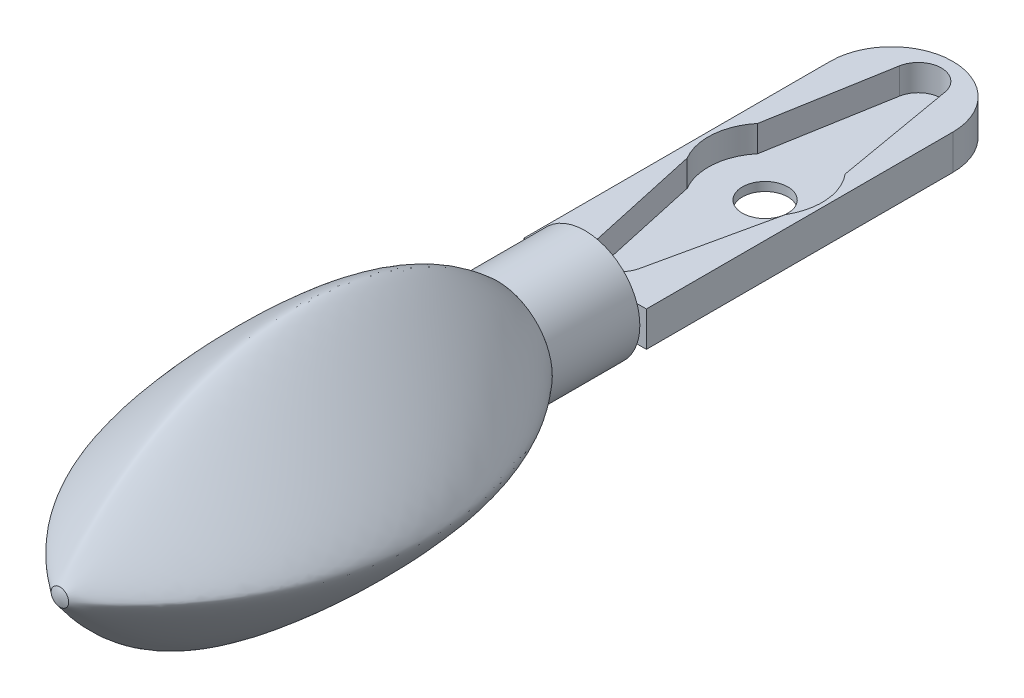
ISO-10303-21;
HEADER;
FILE_DESCRIPTION(('STEP AP214'),'2;1');
FILE_NAME('part.step','',(''),(''),'','','');
FILE_SCHEMA(('AUTOMOTIVE_DESIGN { 1 0 10303 214 1 1 1 1 }'));
ENDSEC;
DATA;
#1=APPLICATION_CONTEXT('core data for automotive mechanical design processes');
#2=APPLICATION_PROTOCOL_DEFINITION('international standard','automotive_design',2000,#1);
#3=PRODUCT_CONTEXT('',#1,'mechanical');
#4=PRODUCT('Part','Part','',(#3));
#5=PRODUCT_RELATED_PRODUCT_CATEGORY('part','',(#4));
#6=PRODUCT_DEFINITION_FORMATION('','',#4);
#7=PRODUCT_DEFINITION_CONTEXT('part definition',#1,'design');
#8=PRODUCT_DEFINITION('design','',#6,#7);
#9=PRODUCT_DEFINITION_SHAPE('','',#8);
#10=(LENGTH_UNIT() NAMED_UNIT(*) SI_UNIT(.MILLI.,.METRE.));
#11=(NAMED_UNIT(*) PLANE_ANGLE_UNIT() SI_UNIT($,.RADIAN.));
#12=(NAMED_UNIT(*) SI_UNIT($,.STERADIAN.) SOLID_ANGLE_UNIT());
#13=UNCERTAINTY_MEASURE_WITH_UNIT(LENGTH_MEASURE(1.E-05),#10,'distance_accuracy_value','');
#14=(GEOMETRIC_REPRESENTATION_CONTEXT(3) GLOBAL_UNCERTAINTY_ASSIGNED_CONTEXT((#13)) GLOBAL_UNIT_ASSIGNED_CONTEXT((#10,
#11,#12)) REPRESENTATION_CONTEXT('',''));
#15=CARTESIAN_POINT('',(0.,0.,0.));
#16=DIRECTION('',(0.,0.,1.));
#17=DIRECTION('',(1.,0.,0.));
#18=AXIS2_PLACEMENT_3D('',#15,#16,#17);
#19=CARTESIAN_POINT('',(7.,-8.25,10.));
#20=DIRECTION('',(0.,0.,1.));
#21=DIRECTION('',(0.,-1.,0.));
#22=AXIS2_PLACEMENT_3D('',#19,#20,#21);
#23=PLANE('',#22);
#24=CARTESIAN_POINT('',(7.,4.25,10.));
#25=CARTESIAN_POINT('',(7.81812308154913,4.25,10.));
#26=CARTESIAN_POINT('',(9.4540963744495,3.92493754223876,10.));
#27=CARTESIAN_POINT('',(11.5345744645811,2.53457446458112,9.99999999999999));
#28=CARTESIAN_POINT('',(12.9249375422388,0.454096374449511,10.));
#29=CARTESIAN_POINT('',(13.25,-1.18187691845087,10.));
#30=CARTESIAN_POINT('',(13.25,-2.81812308154913,10.));
#31=CARTESIAN_POINT('',(12.9249375422387,-4.45409637444951,10.));
#32=CARTESIAN_POINT('',(11.5345744645811,-6.53457446458112,9.99999999999999));
#33=CARTESIAN_POINT('',(9.4540963744495,-7.92493754223876,10.));
#34=CARTESIAN_POINT('',(7.81812308154913,-8.25,10.));
#35=CARTESIAN_POINT('',(6.18187691845087,-8.25,10.));
#36=CARTESIAN_POINT('',(4.54590362555049,-7.92493754223878,10.));
#37=CARTESIAN_POINT('',(2.46542553541888,-6.53457446458111,9.99999999999998));
#38=CARTESIAN_POINT('',(1.07506245776123,-4.45409637444951,10.));
#39=CARTESIAN_POINT('',(0.75,-2.81812308154913,10.));
#40=CARTESIAN_POINT('',(0.75,-1.18187691845087,10.));
#41=CARTESIAN_POINT('',(1.07506245776123,0.454096374449508,10.));
#42=CARTESIAN_POINT('',(2.46542553541888,2.53457446458112,9.99999999999999));
#43=CARTESIAN_POINT('',(4.54590362555049,3.92493754223876,10.));
#44=CARTESIAN_POINT('',(6.18187691845087,4.25,10.));
#45=CARTESIAN_POINT('',(7.,4.25,10.));
#46=B_SPLINE_CURVE_WITH_KNOTS('',3,(#24,#25,#26,#27,#28,#29,#30,#31,#32,#33,#34,#35,#36,#37,#38,
#39,#40,#41,#42,#43,#44,#45),.UNSPECIFIED.,.T.,.F.,(4,1,1,1,2,1,1,1,2,1,1,1,2,1,1,1,4),(0.,
0.0625,0.125,0.1875,0.25,0.3125,0.375,0.4375,0.5,0.5625,0.625,0.6875,0.75,0.8125,0.875,0.9375,
1.),.UNSPECIFIED.);
#47=CARTESIAN_POINT('',(7.,4.25,10.));
#48=VERTEX_POINT('',#47);
#49=EDGE_CURVE('E136',#48,#48,#46,.F.);
#50=ORIENTED_EDGE('',*,*,#49,.F.);
#51=EDGE_LOOP('',(#50));
#52=FACE_BOUND('',#51,.T.);
#53=ADVANCED_FACE('F126',(#52),#23,.F.);
#54=CARTESIAN_POINT('',(8.02000049254447,-3.01999969585642,59.8401923019378));
#55=CARTESIAN_POINT('',(8.0200003708871,-2.61199969585646,59.9616459711477));
#56=CARTESIAN_POINT('',(8.02000024922972,-2.20399969585649,60.0247645805953));
#57=CARTESIAN_POINT('',(8.02000012757235,-1.79599969585653,60.0248127844808));
#58=CARTESIAN_POINT('',(8.02000000591497,-1.38799969585656,59.9616639741347));
#59=CARTESIAN_POINT('',(8.0199998842576,-0.979999695856598,59.839748853044));
#60=CARTESIAN_POINT('',(7.81600045486427,-3.01999975668512,59.8849188797109));
#61=CARTESIAN_POINT('',(7.81600033320689,-2.61199975668515,60.0199655089057));
#62=CARTESIAN_POINT('',(7.81600021154952,-2.20399975668519,60.09365260845));
#63=CARTESIAN_POINT('',(7.81600008989214,-1.79599975668522,60.093563305668));
#64=CARTESIAN_POINT('',(7.81599996823477,-1.38799975668526,60.0200922677023));
#65=CARTESIAN_POINT('',(7.81599984657739,-0.979999756685296,59.8845755523706));
#66=CARTESIAN_POINT('',(7.61200041718406,-3.01999981751382,59.9265692175429));
#67=CARTESIAN_POINT('',(7.61200029552669,-2.61199981751385,60.0757067128921));
#68=CARTESIAN_POINT('',(7.61200017386931,-2.20399981751389,60.1594772058036));
#69=CARTESIAN_POINT('',(7.61200005221194,-1.79599981751392,60.159214782936));
#70=CARTESIAN_POINT('',(7.61199993055456,-1.38799981751396,60.0760089379399));
#71=CARTESIAN_POINT('',(7.61199980889719,-0.979999817513994,59.9262927873224));
#72=CARTESIAN_POINT('',(7.40800037950386,-3.01999987834251,59.9686196393909));
#73=CARTESIAN_POINT('',(7.40800025784648,-2.61199987834255,60.1376041003941));
#74=CARTESIAN_POINT('',(7.40800013618911,-2.20399987834258,60.2263131086476));
#75=CARTESIAN_POINT('',(7.40800001453173,-1.79599987834262,60.2264096595951));
#76=CARTESIAN_POINT('',(7.40799989287436,-1.38799987834266,60.1378791670536));
#77=CARTESIAN_POINT('',(7.40799977121698,-0.979999878342693,59.9683481275886));
#78=CARTESIAN_POINT('',(7.16320032412943,-3.01999995133695,59.9959072130528));
#79=CARTESIAN_POINT('',(7.16320020247206,-2.61199995133699,60.1844968601696));
#80=CARTESIAN_POINT('',(7.16320008081468,-2.20399995133702,60.2659199573564));
#81=CARTESIAN_POINT('',(7.16319995915731,-1.79599995133706,60.2646441625595));
#82=CARTESIAN_POINT('',(7.16319983749993,-1.3879999513371,60.1853156593904));
#83=CARTESIAN_POINT('',(7.16319971584256,-0.979999951337134,59.9955332328288));
#84=CARTESIAN_POINT('',(6.918400268755,-3.0200000243314,59.9906507336328));
#85=CARTESIAN_POINT('',(6.91840014709763,-2.61200002433143,60.1755034043456));
#86=CARTESIAN_POINT('',(6.91840002544025,-2.20400002433147,60.2579290514293));
#87=CARTESIAN_POINT('',(6.91839990378288,-1.7960000243315,60.2568729161097));
#88=CARTESIAN_POINT('',(6.9183997821255,-1.38800002433154,60.1762889863471));
#89=CARTESIAN_POINT('',(6.91839966046813,-0.980000024331575,59.9902196983231));
#90=CARTESIAN_POINT('',(6.87760025106078,-3.02000003649714,59.9888641701939));
#91=CARTESIAN_POINT('',(6.87760012940341,-2.61200003649718,60.1724772690713));
#92=CARTESIAN_POINT('',(6.87760000774603,-2.20400003649721,60.2552582335041));
#93=CARTESIAN_POINT('',(6.87759988608866,-1.79600003649725,60.2542833237004));
#94=CARTESIAN_POINT('',(6.87759976443128,-1.38800003649728,60.1732369409837));
#95=CARTESIAN_POINT('',(6.87759964277391,-0.980000036497318,59.9884309355518));
#96=CARTESIAN_POINT('',(6.67360021266274,-3.02000009732584,59.9756444693519));
#97=CARTESIAN_POINT('',(6.67360009100537,-2.61200009732587,60.1507283404615));
#98=CARTESIAN_POINT('',(6.673599969348,-2.20400009732591,60.2353677353389));
#99=CARTESIAN_POINT('',(6.67359984769062,-1.79600009732594,60.23482117177));
#100=CARTESIAN_POINT('',(6.67359972603325,-1.38800009732598,60.1513214567184));
#101=CARTESIAN_POINT('',(6.67359960437587,-0.980000097326017,59.9752581998762));
#102=CARTESIAN_POINT('',(6.4696001742647,-3.02000015815454,59.9430150733576));
#103=CARTESIAN_POINT('',(6.46960005260733,-2.61200015815457,60.1001411548));
#104=CARTESIAN_POINT('',(6.46959993094996,-2.20400015815461,60.1852168639011));
#105=CARTESIAN_POINT('',(6.46959980929258,-1.79600015815464,60.1848926835552));
#106=CARTESIAN_POINT('',(6.46959968763521,-1.38800015815468,60.1005136973945));
#107=CARTESIAN_POINT('',(6.46959956597783,-0.980000158154716,59.9428866689876));
#108=CARTESIAN_POINT('',(6.30640015356089,-3.02000020681749,59.9106029049298));
#109=CARTESIAN_POINT('',(6.30640003190351,-2.61200020681753,60.0536340980907));
#110=CARTESIAN_POINT('',(6.30639991024614,-2.20400020681756,60.133094695485));
#111=CARTESIAN_POINT('',(6.30639978858877,-1.7960002068176,60.1328027042796));
#112=CARTESIAN_POINT('',(6.30639966693139,-1.38800020681764,60.0537949453785));
#113=CARTESIAN_POINT('',(6.30639954527401,-0.980000206817672,59.9104214773717));
#114=CARTESIAN_POINT('',(6.14320013285707,-3.02000025548045,59.8764373624958));
#115=CARTESIAN_POINT('',(6.14320001119969,-2.61200025548049,60.0081887036456));
#116=CARTESIAN_POINT('',(6.14319988954232,-2.20400025548052,60.0800798010978));
#117=CARTESIAN_POINT('',(6.14319976788495,-1.79600025548056,60.0799890844048));
#118=CARTESIAN_POINT('',(6.14319964622757,-1.38800025548059,60.008226000252));
#119=CARTESIAN_POINT('',(6.14319952457019,-0.980000255480628,59.8761370684449));
#120=CARTESIAN_POINT('',(5.98000011215325,-3.02000030414341,59.8401477532576));
#121=CARTESIAN_POINT('',(5.97999999049587,-2.61200030414344,59.9611093627446));
#122=CARTESIAN_POINT('',(5.9799998688385,-2.20400030414348,60.0249920492741));
#123=CARTESIAN_POINT('',(5.97999974718113,-1.79600030414351,60.0250951911876));
#124=CARTESIAN_POINT('',(5.97999962552375,-1.38800030414355,59.9610455687863));
#125=CARTESIAN_POINT('',(5.97999950386638,-0.980000304143585,59.8397236840152));
#126=B_SPLINE_SURFACE_WITH_KNOTS('',5,5,((#54,#55,#56,#57,#58,#59),(#60,#61,#62,#63,#64,#65),
(#66,#67,#68,#69,#70,#71),(#72,#73,#74,#75,#76,#77),(#78,#79,#80,#81,#82,#83),(#84,#85,#86,#87,
#88,#89),(#90,#91,#92,#93,#94,#95),(#96,#97,#98,#99,#100,#101),(#102,#103,#104,#105,#106,#107),
(#108,#109,#110,#111,#112,#113),(#114,#115,#116,#117,#118,#119),(#120,#121,#122,#123,#124,
#125)),.UNSPECIFIED.,.F.,.F.,.F.,(6,3,3,6),(6,6),(-1.02000024514359,-5.6742517351438E-08,
0.204000031728594,1.02000013524772),(-1.01999999958754,1.02000000041237),.UNSPECIFIED.);
#127=CARTESIAN_POINT('',(7.,-0.999999999999999,60.));
#128=CARTESIAN_POINT('',(7.13089969304786,-0.999999999999999,60.));
#129=CARTESIAN_POINT('',(7.39265108910809,-1.05200892552601,60.));
#130=CARTESIAN_POINT('',(7.72553298434405,-1.27446701565594,59.9999999999999));
#131=CARTESIAN_POINT('',(7.947991074474,-1.60734891089191,60.));
#132=CARTESIAN_POINT('',(8.,-1.86910030695214,60.));
#133=CARTESIAN_POINT('',(8.,-2.13089969304786,60.));
#134=CARTESIAN_POINT('',(7.947991074474,-2.39265108910809,60.));
#135=CARTESIAN_POINT('',(7.72553298434406,-2.72553298434406,60.));
#136=CARTESIAN_POINT('',(7.39265108910809,-2.94799107447399,60.));
#137=CARTESIAN_POINT('',(7.13089969304786,-3.,60.));
#138=CARTESIAN_POINT('',(6.86910030695214,-3.,60.));
#139=CARTESIAN_POINT('',(6.60734891089192,-2.94799107447399,60.0000000000001));
#140=CARTESIAN_POINT('',(6.27446701565593,-2.72553298434406,59.9999999999998));
#141=CARTESIAN_POINT('',(6.05200892552602,-2.39265108910809,60.0000000000001));
#142=CARTESIAN_POINT('',(6.,-2.13089969304786,60.));
#143=CARTESIAN_POINT('',(6.,-1.86910030695214,60.));
#144=CARTESIAN_POINT('',(6.05200892552601,-1.60734891089192,60.));
#145=CARTESIAN_POINT('',(6.27446701565593,-1.27446701565593,60.));
#146=CARTESIAN_POINT('',(6.60734891089192,-1.05200892552601,60.));
#147=CARTESIAN_POINT('',(6.86910030695214,-0.999999999999999,60.));
#148=CARTESIAN_POINT('',(7.,-0.999999999999999,60.));
#149=B_SPLINE_CURVE_WITH_KNOTS('',3,(#127,#128,#129,#130,#131,#132,#133,#134,#135,#136,#137,
#138,#139,#140,#141,#142,#143,#144,#145,#146,#147,#148),.UNSPECIFIED.,.T.,.F.,(4,1,1,1,2,1,1,1,
2,1,1,1,2,1,1,1,4),(0.,0.0625,0.125,0.1875,0.25,0.3125,0.375,0.4375,0.5,0.5625,0.625,0.6875,
0.75,0.8125,0.875,0.9375,1.),.UNSPECIFIED.);
#150=CARTESIAN_POINT('',(7.,-0.999999999999999,60.));
#151=VERTEX_POINT('',#150);
#152=EDGE_CURVE('E13',#151,#151,#149,.T.);
#153=ORIENTED_EDGE('',*,*,#152,.F.);
#154=EDGE_LOOP('',(#153));
#155=FACE_BOUND('',#154,.T.);
#156=ADVANCED_FACE('F160',(#155),#126,.F.);
#157=CARTESIAN_POINT('',(7.,-0.999999999999999,60.));
#158=CARTESIAN_POINT('',(7.,4.19159234922649,56.2589337901821));
#159=CARTESIAN_POINT('',(7.,10.1344041718511,48.6449702266975));
#160=CARTESIAN_POINT('',(7.,13.2680648884993,36.2225218132924));
#161=CARTESIAN_POINT('',(7.,12.7830146271981,23.4201087472026));
#162=CARTESIAN_POINT('',(7.,8.55130920552362,14.7378208730667));
#163=CARTESIAN_POINT('',(7.,4.25,10.));
#164=CARTESIAN_POINT('',(7.13089969304786,-0.999999999999999,60.));
#165=CARTESIAN_POINT('',(7.20725784732578,4.19159234922649,56.2589337901821));
#166=CARTESIAN_POINT('',(7.32179507874266,10.1344041718511,48.6449702266975));
#167=CARTESIAN_POINT('',(7.47451138729849,13.2680648884993,36.2225218132924));
#168=CARTESIAN_POINT('',(7.62722769585433,12.7830146271981,23.4201087472026));
#169=CARTESIAN_POINT('',(7.74176492727121,8.55130920552362,14.7378208730667));
#170=CARTESIAN_POINT('',(7.81812308154913,4.25,10.));
#171=CARTESIAN_POINT('',(7.39265108910809,-1.05200892552601,60.));
#172=CARTESIAN_POINT('',(8.19773294224378,3.53321176535437,56.2589337901821));
#173=CARTESIAN_POINT('',(9.17478363429543,8.79703818811172,48.6449702266976));
#174=CARTESIAN_POINT('',(9.87875684284121,11.6241460857933,36.2225218132924));
#175=CARTESIAN_POINT('',(10.1303911791433,11.2848818777691,23.4201087472026));
#176=CARTESIAN_POINT('',(9.83562721565757,7.64600571176473,14.7378208730667));
#177=CARTESIAN_POINT('',(9.4540963744495,3.92493754223876,10.));
#178=CARTESIAN_POINT('',(7.72553298434405,-1.27446701565594,59.9999999999999));
#179=CARTESIAN_POINT('',(10.4528893234281,1.45288932342809,56.258933790182));
#180=CARTESIAN_POINT('',(13.6216354814466,4.62163548144659,48.6449702266975));
#181=CARTESIAN_POINT('',(15.4515861687123,6.45158616871225,36.2225218132924));
#182=CARTESIAN_POINT('',(15.4721813670032,6.47218136700321,23.4201087472026));
#183=CARTESIAN_POINT('',(13.5536689028722,4.55366890287215,14.7378208730667));
#184=CARTESIAN_POINT('',(11.5345744645811,2.53457446458112,9.99999999999999));
#185=CARTESIAN_POINT('',(7.947991074474,-1.60734891089191,60.));
#186=CARTESIAN_POINT('',(12.5332117653544,-0.802267057756221,56.2589337901821));
#187=CARTESIAN_POINT('',(17.7970381881118,0.17478363429543,48.6449702266976));
#188=CARTESIAN_POINT('',(20.6241460857933,0.878756842841213,36.2225218132925));
#189=CARTESIAN_POINT('',(20.2848818777691,1.13039117914332,23.4201087472026));
#190=CARTESIAN_POINT('',(16.6460057117647,0.835627215657582,14.7378208730667));
#191=CARTESIAN_POINT('',(12.9249375422388,0.454096374449511,10.));
#192=CARTESIAN_POINT('',(8.,-1.86910030695214,60.));
#193=CARTESIAN_POINT('',(13.1915923492265,-1.79274215267422,56.2589337901821));
#194=CARTESIAN_POINT('',(19.1344041718512,-1.67820492125734,48.6449702266976));
#195=CARTESIAN_POINT('',(22.2680648884994,-1.52548861270151,36.2225218132925));
#196=CARTESIAN_POINT('',(21.7830146271981,-1.37277230414567,23.4201087472026));
#197=CARTESIAN_POINT('',(17.5513092055236,-1.25823507272879,14.7378208730667));
#198=CARTESIAN_POINT('',(13.25,-1.18187691845087,10.));
#199=CARTESIAN_POINT('',(8.,-2.13089969304786,60.));
#200=CARTESIAN_POINT('',(13.1915923492265,-2.20725784732578,56.2589337901821));
#201=CARTESIAN_POINT('',(19.1344041718512,-2.32179507874266,48.6449702266976));
#202=CARTESIAN_POINT('',(22.2680648884994,-2.4745113872985,36.2225218132925));
#203=CARTESIAN_POINT('',(21.7830146271981,-2.62722769585433,23.4201087472026));
#204=CARTESIAN_POINT('',(17.5513092055236,-2.74176492727121,14.7378208730667));
#205=CARTESIAN_POINT('',(13.25,-2.81812308154913,10.));
#206=CARTESIAN_POINT('',(7.947991074474,-2.39265108910809,60.));
#207=CARTESIAN_POINT('',(12.5332117653544,-3.19773294224378,56.2589337901821));
#208=CARTESIAN_POINT('',(17.7970381881117,-4.17478363429543,48.6449702266976));
#209=CARTESIAN_POINT('',(20.6241460857933,-4.87875684284121,36.2225218132925));
#210=CARTESIAN_POINT('',(20.2848818777691,-5.13039117914332,23.4201087472026));
#211=CARTESIAN_POINT('',(16.6460057117647,-4.83562721565758,14.7378208730667));
#212=CARTESIAN_POINT('',(12.9249375422387,-4.45409637444951,10.));
#213=CARTESIAN_POINT('',(7.72553298434406,-2.72553298434406,60.));
#214=CARTESIAN_POINT('',(10.4528893234281,-5.45288932342809,56.2589337901821));
#215=CARTESIAN_POINT('',(13.6216354814466,-8.62163548144659,48.6449702266975));
#216=CARTESIAN_POINT('',(15.4515861687123,-10.4515861687123,36.2225218132924));
#217=CARTESIAN_POINT('',(15.4721813670032,-10.4721813670032,23.4201087472026));
#218=CARTESIAN_POINT('',(13.5536689028722,-8.55366890287215,14.7378208730667));
#219=CARTESIAN_POINT('',(11.5345744645811,-6.53457446458112,9.99999999999999));
#220=CARTESIAN_POINT('',(7.39265108910809,-2.94799107447399,60.));
#221=CARTESIAN_POINT('',(8.19773294224378,-7.53321176535437,56.2589337901821));
#222=CARTESIAN_POINT('',(9.17478363429543,-12.7970381881117,48.6449702266976));
#223=CARTESIAN_POINT('',(9.87875684284122,-15.6241460857933,36.2225218132925));
#224=CARTESIAN_POINT('',(10.1303911791433,-15.2848818777691,23.4201087472026));
#225=CARTESIAN_POINT('',(9.83562721565757,-11.6460057117647,14.7378208730667));
#226=CARTESIAN_POINT('',(9.4540963744495,-7.92493754223876,10.));
#227=CARTESIAN_POINT('',(7.13089969304786,-3.,60.));
#228=CARTESIAN_POINT('',(7.20725784732578,-8.19159234922649,56.2589337901821));
#229=CARTESIAN_POINT('',(7.32179507874266,-14.1344041718511,48.6449702266976));
#230=CARTESIAN_POINT('',(7.4745113872985,-17.2680648884993,36.2225218132924));
#231=CARTESIAN_POINT('',(7.62722769585433,-16.7830146271981,23.4201087472026));
#232=CARTESIAN_POINT('',(7.74176492727121,-12.5513092055236,14.7378208730667));
#233=CARTESIAN_POINT('',(7.81812308154913,-8.25,10.));
#234=CARTESIAN_POINT('',(6.86910030695214,-3.,60.));
#235=CARTESIAN_POINT('',(6.79274215267422,-8.19159234922649,56.2589337901821));
#236=CARTESIAN_POINT('',(6.67820492125734,-14.1344041718511,48.6449702266976));
#237=CARTESIAN_POINT('',(6.5254886127015,-17.2680648884993,36.2225218132924));
#238=CARTESIAN_POINT('',(6.37277230414567,-16.7830146271981,23.4201087472026));
#239=CARTESIAN_POINT('',(6.25823507272879,-12.5513092055236,14.7378208730667));
#240=CARTESIAN_POINT('',(6.18187691845087,-8.25,10.));
#241=CARTESIAN_POINT('',(6.60734891089192,-2.94799107447399,60.0000000000001));
#242=CARTESIAN_POINT('',(5.80226705775623,-7.53321176535437,56.2589337901822));
#243=CARTESIAN_POINT('',(4.82521636570457,-12.7970381881117,48.6449702266977));
#244=CARTESIAN_POINT('',(4.12124315715879,-15.6241460857933,36.2225218132925));
#245=CARTESIAN_POINT('',(3.86960882085668,-15.2848818777691,23.4201087472027));
#246=CARTESIAN_POINT('',(4.16437278434242,-11.6460057117648,14.7378208730667));
#247=CARTESIAN_POINT('',(4.54590362555049,-7.92493754223878,10.));
#248=CARTESIAN_POINT('',(6.27446701565593,-2.72553298434406,59.9999999999998));
#249=CARTESIAN_POINT('',(3.5471106765719,-5.45288932342809,56.2589337901819));
#250=CARTESIAN_POINT('',(0.378364518553387,-8.62163548144659,48.6449702266974));
#251=CARTESIAN_POINT('',(-1.45158616871227,-10.4515861687122,36.2225218132923));
#252=CARTESIAN_POINT('',(-1.47218136700324,-10.4721813670032,23.4201087472026));
#253=CARTESIAN_POINT('',(0.446331097127844,-8.55366890287214,14.7378208730666));
#254=CARTESIAN_POINT('',(2.46542553541888,-6.53457446458111,9.99999999999998));
#255=CARTESIAN_POINT('',(6.05200892552602,-2.39265108910809,60.0000000000001));
#256=CARTESIAN_POINT('',(1.46678823464564,-3.19773294224378,56.2589337901822));
#257=CARTESIAN_POINT('',(-3.79703818811175,-4.17478363429543,48.6449702266977));
#258=CARTESIAN_POINT('',(-6.62414608579331,-4.87875684284121,36.2225218132925));
#259=CARTESIAN_POINT('',(-6.28488187776916,-5.13039117914333,23.4201087472027));
#260=CARTESIAN_POINT('',(-2.64600571176475,-4.83562721565759,14.7378208730667));
#261=CARTESIAN_POINT('',(1.07506245776123,-4.45409637444951,10.));
#262=CARTESIAN_POINT('',(6.,-2.13089969304786,60.));
#263=CARTESIAN_POINT('',(0.808407650773506,-2.20725784732578,56.2589337901821));
#264=CARTESIAN_POINT('',(-5.13440417185117,-2.32179507874266,48.6449702266976));
#265=CARTESIAN_POINT('',(-8.26806488849936,-2.47451138729849,36.2225218132924));
#266=CARTESIAN_POINT('',(-7.78301462719816,-2.62722769585433,23.4201087472026));
#267=CARTESIAN_POINT('',(-3.55130920552364,-2.74176492727121,14.7378208730667));
#268=CARTESIAN_POINT('',(0.75,-2.81812308154913,10.));
#269=CARTESIAN_POINT('',(6.,-1.86910030695214,60.));
#270=CARTESIAN_POINT('',(0.808407650773506,-1.79274215267422,56.2589337901821));
#271=CARTESIAN_POINT('',(-5.13440417185117,-1.67820492125734,48.6449702266976));
#272=CARTESIAN_POINT('',(-8.26806488849936,-1.5254886127015,36.2225218132924));
#273=CARTESIAN_POINT('',(-7.78301462719816,-1.37277230414567,23.4201087472026));
#274=CARTESIAN_POINT('',(-3.55130920552364,-1.25823507272879,14.7378208730667));
#275=CARTESIAN_POINT('',(0.75,-1.18187691845087,10.));
#276=CARTESIAN_POINT('',(6.05200892552601,-1.60734891089192,60.));
#277=CARTESIAN_POINT('',(1.46678823464563,-0.802267057756226,56.2589337901821));
#278=CARTESIAN_POINT('',(-3.79703818811175,0.174783634295425,48.6449702266976));
#279=CARTESIAN_POINT('',(-6.62414608579332,0.878756842841211,36.2225218132924));
#280=CARTESIAN_POINT('',(-6.28488187776916,1.13039117914332,23.4201087472026));
#281=CARTESIAN_POINT('',(-2.64600571176475,0.835627215657579,14.7378208730667));
#282=CARTESIAN_POINT('',(1.07506245776123,0.454096374449508,10.));
#283=CARTESIAN_POINT('',(6.27446701565593,-1.27446701565593,60.));
#284=CARTESIAN_POINT('',(3.5471106765719,1.4528893234281,56.2589337901821));
#285=CARTESIAN_POINT('',(0.378364518553387,4.62163548144659,48.6449702266976));
#286=CARTESIAN_POINT('',(-1.45158616871228,6.45158616871226,36.2225218132924));
#287=CARTESIAN_POINT('',(-1.47218136700324,6.47218136700321,23.4201087472026));
#288=CARTESIAN_POINT('',(0.446331097127843,4.55366890287215,14.7378208730667));
#289=CARTESIAN_POINT('',(2.46542553541888,2.53457446458112,9.99999999999999));
#290=CARTESIAN_POINT('',(6.60734891089192,-1.05200892552601,60.));
#291=CARTESIAN_POINT('',(5.80226705775623,3.53321176535437,56.2589337901821));
#292=CARTESIAN_POINT('',(4.82521636570457,8.79703818811173,48.6449702266975));
#293=CARTESIAN_POINT('',(4.12124315715878,11.6241460857933,36.2225218132924));
#294=CARTESIAN_POINT('',(3.86960882085667,11.2848818777691,23.4201087472026));
#295=CARTESIAN_POINT('',(4.16437278434241,7.64600571176473,14.7378208730667));
#296=CARTESIAN_POINT('',(4.54590362555049,3.92493754223876,10.));
#297=CARTESIAN_POINT('',(6.86910030695214,-0.999999999999999,60.));
#298=CARTESIAN_POINT('',(6.79274215267422,4.19159234922649,56.2589337901821));
#299=CARTESIAN_POINT('',(6.67820492125734,10.1344041718511,48.6449702266975));
#300=CARTESIAN_POINT('',(6.5254886127015,13.2680648884993,36.2225218132924));
#301=CARTESIAN_POINT('',(6.37277230414567,12.7830146271981,23.4201087472026));
#302=CARTESIAN_POINT('',(6.25823507272879,8.55130920552362,14.7378208730667));
#303=CARTESIAN_POINT('',(6.18187691845087,4.25,10.));
#304=CARTESIAN_POINT('',(7.,-0.999999999999999,60.));
#305=CARTESIAN_POINT('',(7.,4.19159234922649,56.2589337901821));
#306=CARTESIAN_POINT('',(7.,10.1344041718511,48.6449702266975));
#307=CARTESIAN_POINT('',(7.,13.2680648884993,36.2225218132924));
#308=CARTESIAN_POINT('',(7.,12.7830146271981,23.4201087472026));
#309=CARTESIAN_POINT('',(7.,8.55130920552362,14.7378208730667));
#310=CARTESIAN_POINT('',(7.,4.25,10.));
#311=B_SPLINE_SURFACE_WITH_KNOTS('',3,3,((#157,#158,#159,#160,#161,#162,#163),(#164,#165,#166,
#167,#168,#169,#170),(#171,#172,#173,#174,#175,#176,#177),(#178,#179,#180,#181,#182,#183,#184),
(#185,#186,#187,#188,#189,#190,#191),(#192,#193,#194,#195,#196,#197,#198),(#199,#200,#201,#202,
#203,#204,#205),(#206,#207,#208,#209,#210,#211,#212),(#213,#214,#215,#216,#217,#218,#219),(#220,
#221,#222,#223,#224,#225,#226),(#227,#228,#229,#230,#231,#232,#233),(#234,#235,#236,#237,#238,
#239,#240),(#241,#242,#243,#244,#245,#246,#247),(#248,#249,#250,#251,#252,#253,#254),(#255,#256,
#257,#258,#259,#260,#261),(#262,#263,#264,#265,#266,#267,#268),(#269,#270,#271,#272,#273,#274,
#275),(#276,#277,#278,#279,#280,#281,#282),(#283,#284,#285,#286,#287,#288,#289),(#290,#291,#292,
#293,#294,#295,#296),(#297,#298,#299,#300,#301,#302,#303),(#304,#305,#306,#307,#308,#309,#310)),
.UNSPECIFIED.,.T.,.F.,.F.,(4,1,1,1,2,1,1,1,2,1,1,1,2,1,1,1,4),(4,1,1,1,4),(0.,0.0625,0.125,
0.1875,0.25,0.3125,0.375,0.4375,0.5,0.5625,0.625,0.6875,0.75,0.8125,0.875,0.9375,1.),(0.,
0.333333333333333,0.5,0.666666666666667,1.),.UNSPECIFIED.);
#312=ORIENTED_EDGE('',*,*,#152,.T.);
#313=EDGE_LOOP('',(#312));
#314=FACE_BOUND('',#313,.T.);
#315=ORIENTED_EDGE('',*,*,#49,.T.);
#316=EDGE_LOOP('',(#315));
#317=FACE_BOUND('',#316,.T.);
#318=ADVANCED_FACE('F170',(#314,#317),#311,.T.);
#319=CLOSED_SHELL('',(#53,#156,#318));
#320=MANIFOLD_SOLID_BREP('B2',#319);
#321=CARTESIAN_POINT('',(14.,-4.,0.));
#322=DIRECTION('',(0.,0.,-1.));
#323=DIRECTION('',(-1.,0.,0.));
#324=AXIS2_PLACEMENT_3D('',#321,#322,#323);
#325=PLANE('',#324);
#326=CARTESIAN_POINT('',(7.,-2.,0.));
#327=DIRECTION('',(0.,0.,1.));
#328=DIRECTION('',(1.,0.,0.));
#329=AXIS2_PLACEMENT_3D('',#326,#327,#328);
#330=CIRCLE('',#329,6.25);
#331=CARTESIAN_POINT('',(1.07864035883649,0.,0.));
#332=VERTEX_POINT('',#331);
#333=CARTESIAN_POINT('',(1.07864035883649,-4.,0.));
#334=VERTEX_POINT('',#333);
#335=EDGE_CURVE('E124',#332,#334,#330,.T.);
#336=ORIENTED_EDGE('',*,*,#335,.F.);
#337=DIRECTION('',(-1.,0.,0.));
#338=VECTOR('',#337,1.);
#339=CARTESIAN_POINT('',(14.,0.,0.));
#340=LINE('',#339,#338);
#341=CARTESIAN_POINT('',(0.,0.,0.));
#342=VERTEX_POINT('',#341);
#343=EDGE_CURVE('E329',#332,#342,#340,.T.);
#344=ORIENTED_EDGE('',*,*,#343,.T.);
#345=DIRECTION('',(0.,1.,0.));
#346=VECTOR('',#345,1.);
#347=CARTESIAN_POINT('',(0.,-4.,0.));
#348=LINE('',#347,#346);
#349=CARTESIAN_POINT('',(0.,-4.,0.));
#350=VERTEX_POINT('',#349);
#351=EDGE_CURVE('E342',#350,#342,#348,.T.);
#352=ORIENTED_EDGE('',*,*,#351,.F.);
#353=DIRECTION('',(-1.,0.,0.));
#354=VECTOR('',#353,1.);
#355=CARTESIAN_POINT('',(14.,-4.,0.));
#356=LINE('',#355,#354);
#357=EDGE_CURVE('E235',#334,#350,#356,.T.);
#358=ORIENTED_EDGE('',*,*,#357,.F.);
#359=EDGE_LOOP('',(#336,#344,#352,#358));
#360=FACE_BOUND('',#359,.T.);
#361=ADVANCED_FACE('F217',(#360),#325,.F.);
#362=CARTESIAN_POINT('',(12.9213596411635,-4.,0.));
#363=VERTEX_POINT('',#362);
#364=CARTESIAN_POINT('',(12.9213596411635,0.,0.));
#365=VERTEX_POINT('',#364);
#366=EDGE_CURVE('E226',#363,#365,#330,.T.);
#367=ORIENTED_EDGE('',*,*,#366,.F.);
#368=CARTESIAN_POINT('',(14.,-4.,0.));
#369=VERTEX_POINT('',#368);
#370=EDGE_CURVE('E413',#369,#363,#356,.T.);
#371=ORIENTED_EDGE('',*,*,#370,.F.);
#372=DIRECTION('',(0.,1.,0.));
#373=VECTOR('',#372,1.);
#374=CARTESIAN_POINT('',(14.,-4.,0.));
#375=LINE('',#374,#373);
#376=CARTESIAN_POINT('',(14.,0.,0.));
#377=VERTEX_POINT('',#376);
#378=EDGE_CURVE('E323',#369,#377,#375,.T.);
#379=ORIENTED_EDGE('',*,*,#378,.T.);
#380=EDGE_CURVE('E320',#377,#365,#340,.T.);
#381=ORIENTED_EDGE('',*,*,#380,.T.);
#382=EDGE_LOOP('',(#367,#371,#379,#381));
#383=FACE_BOUND('',#382,.T.);
#384=ADVANCED_FACE('F219',(#383),#325,.F.);
#385=CARTESIAN_POINT('',(0.,-4.,0.));
#386=DIRECTION('',(1.,0.,0.));
#387=DIRECTION('',(0.,0.,-1.));
#388=AXIS2_PLACEMENT_3D('',#385,#386,#387);
#389=PLANE('',#388);
#390=DIRECTION('',(0.,0.,-1.));
#391=VECTOR('',#390,1.);
#392=CARTESIAN_POINT('',(0.,0.,0.));
#393=LINE('',#392,#391);
#394=CARTESIAN_POINT('',(0.,0.,-35.));
#395=VERTEX_POINT('',#394);
#396=EDGE_CURVE('E326',#342,#395,#393,.T.);
#397=ORIENTED_EDGE('',*,*,#396,.T.);
#398=DIRECTION('',(0.,1.,0.));
#399=VECTOR('',#398,1.);
#400=CARTESIAN_POINT('',(0.,-4.,-35.));
#401=LINE('',#400,#399);
#402=CARTESIAN_POINT('',(0.,-4.,-35.));
#403=VERTEX_POINT('',#402);
#404=EDGE_CURVE('E431',#403,#395,#401,.T.);
#405=ORIENTED_EDGE('',*,*,#404,.F.);
#406=DIRECTION('',(0.,0.,-1.));
#407=VECTOR('',#406,1.);
#408=CARTESIAN_POINT('',(0.,-4.,0.));
#409=LINE('',#408,#407);
#410=EDGE_CURVE('E415',#350,#403,#409,.T.);
#411=ORIENTED_EDGE('',*,*,#410,.F.);
#412=ORIENTED_EDGE('',*,*,#351,.T.);
#413=EDGE_LOOP('',(#397,#405,#411,#412));
#414=FACE_BOUND('',#413,.T.);
#415=ADVANCED_FACE('F436',(#414),#389,.F.);
#416=CARTESIAN_POINT('',(7.,-4.,-35.));
#417=DIRECTION('',(0.,1.,0.));
#418=DIRECTION('',(0.,0.,1.));
#419=AXIS2_PLACEMENT_3D('',#416,#417,#418);
#420=CYLINDRICAL_SURFACE('',#419,7.);
#421=CARTESIAN_POINT('',(7.,0.,-35.));
#422=DIRECTION('',(0.,-1.,0.));
#423=DIRECTION('',(0.,0.,-1.));
#424=AXIS2_PLACEMENT_3D('',#421,#422,#423);
#425=CIRCLE('',#424,7.);
#426=CARTESIAN_POINT('',(14.,0.,-35.));
#427=VERTEX_POINT('',#426);
#428=EDGE_CURVE('E423',#395,#427,#425,.T.);
#429=ORIENTED_EDGE('',*,*,#428,.T.);
#430=DIRECTION('',(0.,1.,0.));
#431=VECTOR('',#430,1.);
#432=CARTESIAN_POINT('',(14.,-4.,-35.));
#433=LINE('',#432,#431);
#434=CARTESIAN_POINT('',(14.,-4.,-35.));
#435=VERTEX_POINT('',#434);
#436=EDGE_CURVE('E428',#435,#427,#433,.T.);
#437=ORIENTED_EDGE('',*,*,#436,.F.);
#438=CARTESIAN_POINT('',(7.,-4.,-35.));
#439=DIRECTION('',(0.,-1.,0.));
#440=DIRECTION('',(0.,0.,-1.));
#441=AXIS2_PLACEMENT_3D('',#438,#439,#440);
#442=CIRCLE('',#441,7.);
#443=EDGE_CURVE('E418',#403,#435,#442,.T.);
#444=ORIENTED_EDGE('',*,*,#443,.F.);
#445=ORIENTED_EDGE('',*,*,#404,.T.);
#446=EDGE_LOOP('',(#429,#437,#444,#445));
#447=FACE_BOUND('',#446,.T.);
#448=ADVANCED_FACE('F441',(#447),#420,.T.);
#449=CARTESIAN_POINT('',(14.,-4.,-35.));
#450=DIRECTION('',(-1.,0.,0.));
#451=DIRECTION('',(0.,0.,1.));
#452=AXIS2_PLACEMENT_3D('',#449,#450,#451);
#453=PLANE('',#452);
#454=DIRECTION('',(0.,0.,1.));
#455=VECTOR('',#454,1.);
#456=CARTESIAN_POINT('',(14.,0.,-35.));
#457=LINE('',#456,#455);
#458=EDGE_CURVE('E425',#427,#377,#457,.T.);
#459=ORIENTED_EDGE('',*,*,#458,.T.);
#460=ORIENTED_EDGE('',*,*,#378,.F.);
#461=DIRECTION('',(0.,0.,1.));
#462=VECTOR('',#461,1.);
#463=CARTESIAN_POINT('',(14.,-4.,-35.));
#464=LINE('',#463,#462);
#465=EDGE_CURVE('E420',#435,#369,#464,.T.);
#466=ORIENTED_EDGE('',*,*,#465,.F.);
#467=ORIENTED_EDGE('',*,*,#436,.T.);
#468=EDGE_LOOP('',(#459,#460,#466,#467));
#469=FACE_BOUND('',#468,.T.);
#470=ADVANCED_FACE('F445',(#469),#453,.F.);
#471=CARTESIAN_POINT('',(7.,-4.,-35.));
#472=DIRECTION('',(0.,-1.,0.));
#473=DIRECTION('',(0.,0.,-1.));
#474=AXIS2_PLACEMENT_3D('',#471,#472,#473);
#475=PLANE('',#474);
#476=CARTESIAN_POINT('',(7.,-4.,-20.5602345410471));
#477=DIRECTION('',(0.,1.,0.));
#478=DIRECTION('',(0.,0.,1.));
#479=AXIS2_PLACEMENT_3D('',#476,#477,#478);
#480=CIRCLE('',#479,2.6);
#481=CARTESIAN_POINT('',(7.,-4.,-17.9602345410471));
#482=VERTEX_POINT('',#481);
#483=EDGE_CURVE('E346',#482,#482,#480,.T.);
#484=ORIENTED_EDGE('',*,*,#483,.T.);
#485=EDGE_LOOP('',(#484));
#486=FACE_BOUND('',#485,.T.);
#487=ORIENTED_EDGE('',*,*,#370,.T.);
#488=EDGE_CURVE('E416',#363,#334,#356,.T.);
#489=ORIENTED_EDGE('',*,*,#488,.T.);
#490=ORIENTED_EDGE('',*,*,#357,.T.);
#491=ORIENTED_EDGE('',*,*,#410,.T.);
#492=ORIENTED_EDGE('',*,*,#443,.T.);
#493=ORIENTED_EDGE('',*,*,#465,.T.);
#494=EDGE_LOOP('',(#487,#489,#490,#491,#492,#493));
#495=FACE_BOUND('',#494,.T.);
#496=ADVANCED_FACE('F447',(#486,#495),#475,.T.);
#497=CARTESIAN_POINT('',(7.,0.,-35.));
#498=DIRECTION('',(0.,-1.,0.));
#499=DIRECTION('',(0.,0.,-1.));
#500=AXIS2_PLACEMENT_3D('',#497,#498,#499);
#501=PLANE('',#500);
#502=DIRECTION('',(-0.171428571428571,0.,0.98519655140381));
#503=VECTOR('',#502,1.);
#504=CARTESIAN_POINT('',(4.4,0.,-38.5062981921595));
#505=LINE('',#504,#503);
#506=CARTESIAN_POINT('',(4.4,0.,-38.5062981921595));
#507=VERTEX_POINT('',#506);
#508=CARTESIAN_POINT('',(2.,0.,-24.7135464725062));
#509=VERTEX_POINT('',#508);
#510=EDGE_CURVE('E377',#507,#509,#505,.T.);
#511=ORIENTED_EDGE('',*,*,#510,.F.);
#512=CARTESIAN_POINT('',(7.,0.,-38.0538866555182));
#513=DIRECTION('',(0.,1.,0.));
#514=DIRECTION('',(0.,0.,1.));
#515=AXIS2_PLACEMENT_3D('',#512,#513,#514);
#516=CIRCLE('',#515,2.63906729707412);
#517=CARTESIAN_POINT('',(9.6,0.,-38.5062981921595));
#518=VERTEX_POINT('',#517);
#519=EDGE_CURVE('E375',#518,#507,#516,.T.);
#520=ORIENTED_EDGE('',*,*,#519,.F.);
#521=DIRECTION('',(0.171428571428571,0.,0.98519655140381));
#522=VECTOR('',#521,1.);
#523=CARTESIAN_POINT('',(9.6,0.,-38.5062981921595));
#524=LINE('',#523,#522);
#525=CARTESIAN_POINT('',(12.,0.,-24.7135464725062));
#526=VERTEX_POINT('',#525);
#527=EDGE_CURVE('E355',#518,#526,#524,.T.);
#528=ORIENTED_EDGE('',*,*,#527,.T.);
#529=CARTESIAN_POINT('',(7.,0.,-20.5602345410471));
#530=DIRECTION('',(0.,1.,0.));
#531=DIRECTION('',(0.,0.,1.));
#532=AXIS2_PLACEMENT_3D('',#529,#530,#531);
#533=CIRCLE('',#532,6.5);
#534=CARTESIAN_POINT('',(12.6028914192137,0.,-17.2651461136295));
#535=VERTEX_POINT('',#534);
#536=EDGE_CURVE('E392',#535,#526,#533,.T.);
#537=ORIENTED_EDGE('',*,*,#536,.F.);
#538=DIRECTION('',(-0.214492244229548,0.,0.976725691873297));
#539=VECTOR('',#538,1.);
#540=CARTESIAN_POINT('',(12.6028914192137,0.,-17.2651461136295));
#541=LINE('',#540,#539);
#542=CARTESIAN_POINT('',(9.6,0.,-3.59098642740331));
#543=VERTEX_POINT('',#542);
#544=EDGE_CURVE('E389',#535,#543,#541,.T.);
#545=ORIENTED_EDGE('',*,*,#544,.T.);
#546=CARTESIAN_POINT('',(7.,0.,-4.16195516472324));
#547=DIRECTION('',(0.,1.,0.));
#548=DIRECTION('',(0.,0.,1.));
#549=AXIS2_PLACEMENT_3D('',#546,#547,#548);
#550=CIRCLE('',#549,2.66195516472324);
#551=CARTESIAN_POINT('',(4.4,0.,-3.59098642740331));
#552=VERTEX_POINT('',#551);
#553=EDGE_CURVE('E386',#552,#543,#550,.T.);
#554=ORIENTED_EDGE('',*,*,#553,.F.);
#555=DIRECTION('',(0.214492244229548,0.,0.976725691873297));
#556=VECTOR('',#555,1.);
#557=CARTESIAN_POINT('',(1.39710858078632,0.,-17.2651461136295));
#558=LINE('',#557,#556);
#559=CARTESIAN_POINT('',(1.39710858078632,0.,-17.2651461136295));
#560=VERTEX_POINT('',#559);
#561=EDGE_CURVE('E383',#560,#552,#558,.T.);
#562=ORIENTED_EDGE('',*,*,#561,.F.);
#563=CARTESIAN_POINT('',(7.,0.,-20.5602345410471));
#564=DIRECTION('',(0.,1.,0.));
#565=DIRECTION('',(0.,0.,1.));
#566=AXIS2_PLACEMENT_3D('',#563,#564,#565);
#567=CIRCLE('',#566,6.5);
#568=EDGE_CURVE('E380',#509,#560,#567,.T.);
#569=ORIENTED_EDGE('',*,*,#568,.F.);
#570=EDGE_LOOP('',(#511,#520,#528,#537,#545,#554,#562,#569));
#571=FACE_BOUND('',#570,.T.);
#572=ORIENTED_EDGE('',*,*,#380,.F.);
#573=ORIENTED_EDGE('',*,*,#458,.F.);
#574=ORIENTED_EDGE('',*,*,#428,.F.);
#575=ORIENTED_EDGE('',*,*,#396,.F.);
#576=ORIENTED_EDGE('',*,*,#343,.F.);
#577=EDGE_CURVE('E327',#365,#332,#340,.T.);
#578=ORIENTED_EDGE('',*,*,#577,.F.);
#579=EDGE_LOOP('',(#572,#573,#574,#575,#576,#578));
#580=FACE_BOUND('',#579,.T.);
#581=ADVANCED_FACE('F332',(#571,#580),#501,.F.);
#582=CARTESIAN_POINT('',(7.,-3.,-38.0538866555182));
#583=DIRECTION('',(0.,1.,0.));
#584=DIRECTION('',(0.,0.,1.));
#585=AXIS2_PLACEMENT_3D('',#582,#583,#584);
#586=CYLINDRICAL_SURFACE('',#585,2.63906729707412);
#587=ORIENTED_EDGE('',*,*,#519,.T.);
#588=DIRECTION('',(0.,1.,0.));
#589=VECTOR('',#588,1.);
#590=CARTESIAN_POINT('',(4.4,-3.,-38.5062981921595));
#591=LINE('',#590,#589);
#592=CARTESIAN_POINT('',(4.4,-3.,-38.5062981921595));
#593=VERTEX_POINT('',#592);
#594=EDGE_CURVE('E374',#593,#507,#591,.T.);
#595=ORIENTED_EDGE('',*,*,#594,.F.);
#596=CARTESIAN_POINT('',(7.,-3.,-38.0538866555182));
#597=DIRECTION('',(0.,1.,0.));
#598=DIRECTION('',(0.,0.,1.));
#599=AXIS2_PLACEMENT_3D('',#596,#597,#598);
#600=CIRCLE('',#599,2.63906729707412);
#601=CARTESIAN_POINT('',(9.6,-3.,-38.5062981921595));
#602=VERTEX_POINT('',#601);
#603=EDGE_CURVE('E351',#602,#593,#600,.T.);
#604=ORIENTED_EDGE('',*,*,#603,.F.);
#605=DIRECTION('',(0.,1.,0.));
#606=VECTOR('',#605,1.);
#607=CARTESIAN_POINT('',(9.6,-3.,-38.5062981921595));
#608=LINE('',#607,#606);
#609=EDGE_CURVE('E397',#602,#518,#608,.T.);
#610=ORIENTED_EDGE('',*,*,#609,.T.);
#611=EDGE_LOOP('',(#587,#595,#604,#610));
#612=FACE_BOUND('',#611,.T.);
#613=ADVANCED_FACE('F478',(#612),#586,.F.);
#614=CARTESIAN_POINT('',(9.6,-3.,-38.5062981921595));
#615=DIRECTION('',(-0.985196551403809,0.,0.171428571428571));
#616=DIRECTION('',(0.171428571428571,0.,0.98519655140381));
#617=AXIS2_PLACEMENT_3D('',#614,#615,#616);
#618=PLANE('',#617);
#619=ORIENTED_EDGE('',*,*,#527,.F.);
#620=ORIENTED_EDGE('',*,*,#609,.F.);
#621=DIRECTION('',(0.171428571428571,0.,0.98519655140381));
#622=VECTOR('',#621,1.);
#623=CARTESIAN_POINT('',(9.6,-3.,-38.5062981921595));
#624=LINE('',#623,#622);
#625=CARTESIAN_POINT('',(12.,-3.,-24.7135464725062));
#626=VERTEX_POINT('',#625);
#627=EDGE_CURVE('E372',#602,#626,#624,.T.);
#628=ORIENTED_EDGE('',*,*,#627,.T.);
#629=DIRECTION('',(0.,1.,0.));
#630=VECTOR('',#629,1.);
#631=CARTESIAN_POINT('',(12.,-3.,-24.7135464725062));
#632=LINE('',#631,#630);
#633=EDGE_CURVE('E399',#626,#526,#632,.T.);
#634=ORIENTED_EDGE('',*,*,#633,.T.);
#635=EDGE_LOOP('',(#619,#620,#628,#634));
#636=FACE_BOUND('',#635,.T.);
#637=ADVANCED_FACE('F485',(#636),#618,.T.);
#638=CARTESIAN_POINT('',(7.,-3.,-20.5602345410471));
#639=DIRECTION('',(0.,1.,0.));
#640=DIRECTION('',(0.,0.,1.));
#641=AXIS2_PLACEMENT_3D('',#638,#639,#640);
#642=CYLINDRICAL_SURFACE('',#641,6.5);
#643=ORIENTED_EDGE('',*,*,#536,.T.);
#644=ORIENTED_EDGE('',*,*,#633,.F.);
#645=CARTESIAN_POINT('',(7.,-3.,-20.5602345410471));
#646=DIRECTION('',(0.,1.,0.));
#647=DIRECTION('',(0.,0.,1.));
#648=AXIS2_PLACEMENT_3D('',#645,#646,#647);
#649=CIRCLE('',#648,6.5);
#650=CARTESIAN_POINT('',(12.6028914192137,-3.,-17.2651461136295));
#651=VERTEX_POINT('',#650);
#652=EDGE_CURVE('E369',#651,#626,#649,.T.);
#653=ORIENTED_EDGE('',*,*,#652,.F.);
#654=DIRECTION('',(0.,1.,0.));
#655=VECTOR('',#654,1.);
#656=CARTESIAN_POINT('',(12.6028914192137,-3.,-17.2651461136295));
#657=LINE('',#656,#655);
#658=EDGE_CURVE('E401',#651,#535,#657,.T.);
#659=ORIENTED_EDGE('',*,*,#658,.T.);
#660=EDGE_LOOP('',(#643,#644,#653,#659));
#661=FACE_BOUND('',#660,.T.);
#662=ADVANCED_FACE('F507',(#661),#642,.F.);
#663=CARTESIAN_POINT('',(12.6028914192137,-3.,-17.2651461136295));
#664=DIRECTION('',(-0.976725691873298,0.,-0.214492244229548));
#665=DIRECTION('',(-0.214492244229548,0.,0.976725691873298));
#666=AXIS2_PLACEMENT_3D('',#663,#664,#665);
#667=PLANE('',#666);
#668=ORIENTED_EDGE('',*,*,#544,.F.);
#669=ORIENTED_EDGE('',*,*,#658,.F.);
#670=DIRECTION('',(-0.214492244229548,0.,0.976725691873297));
#671=VECTOR('',#670,1.);
#672=CARTESIAN_POINT('',(12.6028914192137,-3.,-17.2651461136295));
#673=LINE('',#672,#671);
#674=CARTESIAN_POINT('',(9.6,-3.,-3.59098642740331));
#675=VERTEX_POINT('',#674);
#676=EDGE_CURVE('E367',#651,#675,#673,.T.);
#677=ORIENTED_EDGE('',*,*,#676,.T.);
#678=DIRECTION('',(0.,1.,0.));
#679=VECTOR('',#678,1.);
#680=CARTESIAN_POINT('',(9.6,-3.,-3.59098642740331));
#681=LINE('',#680,#679);
#682=EDGE_CURVE('E403',#675,#543,#681,.T.);
#683=ORIENTED_EDGE('',*,*,#682,.T.);
#684=EDGE_LOOP('',(#668,#669,#677,#683));
#685=FACE_BOUND('',#684,.T.);
#686=ADVANCED_FACE('F503',(#685),#667,.T.);
#687=CARTESIAN_POINT('',(7.,-3.,-4.16195516472324));
#688=DIRECTION('',(0.,1.,0.));
#689=DIRECTION('',(0.,0.,1.));
#690=AXIS2_PLACEMENT_3D('',#687,#688,#689);
#691=CYLINDRICAL_SURFACE('',#690,2.66195516472324);
#692=ORIENTED_EDGE('',*,*,#553,.T.);
#693=ORIENTED_EDGE('',*,*,#682,.F.);
#694=CARTESIAN_POINT('',(7.,-3.,-4.16195516472324));
#695=DIRECTION('',(0.,1.,0.));
#696=DIRECTION('',(0.,0.,1.));
#697=AXIS2_PLACEMENT_3D('',#694,#695,#696);
#698=CIRCLE('',#697,2.66195516472324);
#699=CARTESIAN_POINT('',(4.4,-3.,-3.59098642740331));
#700=VERTEX_POINT('',#699);
#701=EDGE_CURVE('E364',#700,#675,#698,.T.);
#702=ORIENTED_EDGE('',*,*,#701,.F.);
#703=DIRECTION('',(0.,1.,0.));
#704=VECTOR('',#703,1.);
#705=CARTESIAN_POINT('',(4.4,-3.,-3.59098642740331));
#706=LINE('',#705,#704);
#707=EDGE_CURVE('E405',#700,#552,#706,.T.);
#708=ORIENTED_EDGE('',*,*,#707,.T.);
#709=EDGE_LOOP('',(#692,#693,#702,#708));
#710=FACE_BOUND('',#709,.T.);
#711=ADVANCED_FACE('F499',(#710),#691,.F.);
#712=CARTESIAN_POINT('',(1.39710858078632,-3.,-17.2651461136295));
#713=DIRECTION('',(-0.976725691873297,0.,0.214492244229548));
#714=DIRECTION('',(0.214492244229548,0.,0.976725691873297));
#715=AXIS2_PLACEMENT_3D('',#712,#713,#714);
#716=PLANE('',#715);
#717=ORIENTED_EDGE('',*,*,#561,.T.);
#718=ORIENTED_EDGE('',*,*,#707,.F.);
#719=DIRECTION('',(0.214492244229548,0.,0.976725691873297));
#720=VECTOR('',#719,1.);
#721=CARTESIAN_POINT('',(1.39710858078632,-3.,-17.2651461136295));
#722=LINE('',#721,#720);
#723=CARTESIAN_POINT('',(1.39710858078632,-3.,-17.2651461136295));
#724=VERTEX_POINT('',#723);
#725=EDGE_CURVE('E361',#724,#700,#722,.T.);
#726=ORIENTED_EDGE('',*,*,#725,.F.);
#727=DIRECTION('',(0.,1.,0.));
#728=VECTOR('',#727,1.);
#729=CARTESIAN_POINT('',(1.39710858078632,-3.,-17.2651461136295));
#730=LINE('',#729,#728);
#731=EDGE_CURVE('E407',#724,#560,#730,.T.);
#732=ORIENTED_EDGE('',*,*,#731,.T.);
#733=EDGE_LOOP('',(#717,#718,#726,#732));
#734=FACE_BOUND('',#733,.T.);
#735=ADVANCED_FACE('F495',(#734),#716,.F.);
#736=CARTESIAN_POINT('',(7.,-3.,-20.5602345410471));
#737=DIRECTION('',(0.,1.,0.));
#738=DIRECTION('',(0.,0.,1.));
#739=AXIS2_PLACEMENT_3D('',#736,#737,#738);
#740=CYLINDRICAL_SURFACE('',#739,6.5);
#741=ORIENTED_EDGE('',*,*,#568,.T.);
#742=ORIENTED_EDGE('',*,*,#731,.F.);
#743=CARTESIAN_POINT('',(7.,-3.,-20.5602345410471));
#744=DIRECTION('',(0.,1.,0.));
#745=DIRECTION('',(0.,0.,1.));
#746=AXIS2_PLACEMENT_3D('',#743,#744,#745);
#747=CIRCLE('',#746,6.5);
#748=CARTESIAN_POINT('',(2.,-3.,-24.7135464725062));
#749=VERTEX_POINT('',#748);
#750=EDGE_CURVE('E358',#749,#724,#747,.T.);
#751=ORIENTED_EDGE('',*,*,#750,.F.);
#752=DIRECTION('',(0.,1.,0.));
#753=VECTOR('',#752,1.);
#754=CARTESIAN_POINT('',(2.,-3.,-24.7135464725062));
#755=LINE('',#754,#753);
#756=EDGE_CURVE('E409',#749,#509,#755,.T.);
#757=ORIENTED_EDGE('',*,*,#756,.T.);
#758=EDGE_LOOP('',(#741,#742,#751,#757));
#759=FACE_BOUND('',#758,.T.);
#760=ADVANCED_FACE('F491',(#759),#740,.F.);
#761=CARTESIAN_POINT('',(4.4,-3.,-38.5062981921595));
#762=DIRECTION('',(-0.985196551403809,0.,-0.171428571428571));
#763=DIRECTION('',(-0.171428571428571,0.,0.98519655140381));
#764=AXIS2_PLACEMENT_3D('',#761,#762,#763);
#765=PLANE('',#764);
#766=ORIENTED_EDGE('',*,*,#510,.T.);
#767=ORIENTED_EDGE('',*,*,#756,.F.);
#768=DIRECTION('',(-0.171428571428571,0.,0.98519655140381));
#769=VECTOR('',#768,1.);
#770=CARTESIAN_POINT('',(4.4,-3.,-38.5062981921595));
#771=LINE('',#770,#769);
#772=EDGE_CURVE('E354',#593,#749,#771,.T.);
#773=ORIENTED_EDGE('',*,*,#772,.F.);
#774=ORIENTED_EDGE('',*,*,#594,.T.);
#775=EDGE_LOOP('',(#766,#767,#773,#774));
#776=FACE_BOUND('',#775,.T.);
#777=ADVANCED_FACE('F487',(#776),#765,.F.);
#778=CARTESIAN_POINT('',(7.,-3.,-38.0538866555182));
#779=DIRECTION('',(0.,1.,0.));
#780=DIRECTION('',(0.,0.,1.));
#781=AXIS2_PLACEMENT_3D('',#778,#779,#780);
#782=PLANE('',#781);
#783=CARTESIAN_POINT('',(7.,-3.,-20.5602345410471));
#784=DIRECTION('',(0.,1.,0.));
#785=DIRECTION('',(0.,0.,1.));
#786=AXIS2_PLACEMENT_3D('',#783,#784,#785);
#787=CIRCLE('',#786,2.6);
#788=CARTESIAN_POINT('',(7.,-3.,-17.9602345410471));
#789=VERTEX_POINT('',#788);
#790=EDGE_CURVE('E221',#789,#789,#787,.T.);
#791=ORIENTED_EDGE('',*,*,#790,.F.);
#792=EDGE_LOOP('',(#791));
#793=FACE_BOUND('',#792,.T.);
#794=ORIENTED_EDGE('',*,*,#603,.T.);
#795=ORIENTED_EDGE('',*,*,#772,.T.);
#796=ORIENTED_EDGE('',*,*,#750,.T.);
#797=ORIENTED_EDGE('',*,*,#725,.T.);
#798=ORIENTED_EDGE('',*,*,#701,.T.);
#799=ORIENTED_EDGE('',*,*,#676,.F.);
#800=ORIENTED_EDGE('',*,*,#652,.T.);
#801=ORIENTED_EDGE('',*,*,#627,.F.);
#802=EDGE_LOOP('',(#794,#795,#796,#797,#798,#799,#800,#801));
#803=FACE_BOUND('',#802,.T.);
#804=ADVANCED_FACE('F490',(#793,#803),#782,.T.);
#805=CARTESIAN_POINT('',(7.,-4.,-20.5602345410471));
#806=DIRECTION('',(0.,1.,0.));
#807=DIRECTION('',(0.,0.,1.));
#808=AXIS2_PLACEMENT_3D('',#805,#806,#807);
#809=CYLINDRICAL_SURFACE('',#808,2.6);
#810=ORIENTED_EDGE('',*,*,#790,.T.);
#811=EDGE_LOOP('',(#810));
#812=FACE_BOUND('',#811,.T.);
#813=ORIENTED_EDGE('',*,*,#483,.F.);
#814=EDGE_LOOP('',(#813));
#815=FACE_BOUND('',#814,.T.);
#816=ADVANCED_FACE('F461',(#812,#815),#809,.F.);
#817=CARTESIAN_POINT('',(7.,-2.,0.));
#818=DIRECTION('',(0.,0.,1.));
#819=DIRECTION('',(1.,0.,0.));
#820=AXIS2_PLACEMENT_3D('',#817,#818,#819);
#821=PLANE('',#820);
#822=EDGE_CURVE('E340',#365,#332,#330,.T.);
#823=ORIENTED_EDGE('',*,*,#822,.F.);
#824=ORIENTED_EDGE('',*,*,#577,.T.);
#825=EDGE_LOOP('',(#823,#824));
#826=FACE_BOUND('',#825,.T.);
#827=ADVANCED_FACE('F343',(#826),#821,.F.);
#828=CARTESIAN_POINT('',(7.,-2.,10.));
#829=DIRECTION('',(0.,0.,-1.));
#830=DIRECTION('',(-1.,0.,0.));
#831=AXIS2_PLACEMENT_3D('',#828,#829,#830);
#832=CYLINDRICAL_SURFACE('',#831,6.25);
#833=CARTESIAN_POINT('',(7.,-2.,10.));
#834=DIRECTION('',(0.,0.,1.));
#835=DIRECTION('',(1.,0.,0.));
#836=AXIS2_PLACEMENT_3D('',#833,#834,#835);
#837=CIRCLE('',#836,6.25);
#838=CARTESIAN_POINT('',(13.25,-2.,10.));
#839=VERTEX_POINT('',#838);
#840=EDGE_CURVE('E344',#839,#839,#837,.T.);
#841=ORIENTED_EDGE('',*,*,#840,.F.);
#842=EDGE_LOOP('',(#841));
#843=FACE_BOUND('',#842,.T.);
#844=ORIENTED_EDGE('',*,*,#822,.T.);
#845=ORIENTED_EDGE('',*,*,#335,.T.);
#846=EDGE_CURVE('E228',#334,#363,#330,.T.);
#847=ORIENTED_EDGE('',*,*,#846,.T.);
#848=ORIENTED_EDGE('',*,*,#366,.T.);
#849=EDGE_LOOP('',(#844,#845,#847,#848));
#850=FACE_BOUND('',#849,.T.);
#851=ADVANCED_FACE('F339',(#843,#850),#832,.T.);
#852=CARTESIAN_POINT('',(7.,-2.,10.));
#853=DIRECTION('',(0.,0.,1.));
#854=DIRECTION('',(1.,0.,0.));
#855=AXIS2_PLACEMENT_3D('',#852,#853,#854);
#856=PLANE('',#855);
#857=ORIENTED_EDGE('',*,*,#840,.T.);
#858=EDGE_LOOP('',(#857));
#859=FACE_BOUND('',#858,.T.);
#860=ADVANCED_FACE('F452',(#859),#856,.T.);
#861=ORIENTED_EDGE('',*,*,#488,.F.);
#862=ORIENTED_EDGE('',*,*,#846,.F.);
#863=EDGE_LOOP('',(#861,#862));
#864=FACE_BOUND('',#863,.T.);
#865=ADVANCED_FACE('F450',(#864),#821,.F.);
#866=CLOSED_SHELL('',(#361,#384,#415,#448,#470,#496,#581,#613,#637,#662,#686,#711,#735,#760,
#777,#804,#816,#827,#851,#860,#865));
#867=MANIFOLD_SOLID_BREP('B8',#866);
#868=ADVANCED_BREP_SHAPE_REPRESENTATION('',(#18,#320,#867),#14);
#869=SHAPE_DEFINITION_REPRESENTATION(#9,#868);
ENDSEC;
END-ISO-10303-21;
